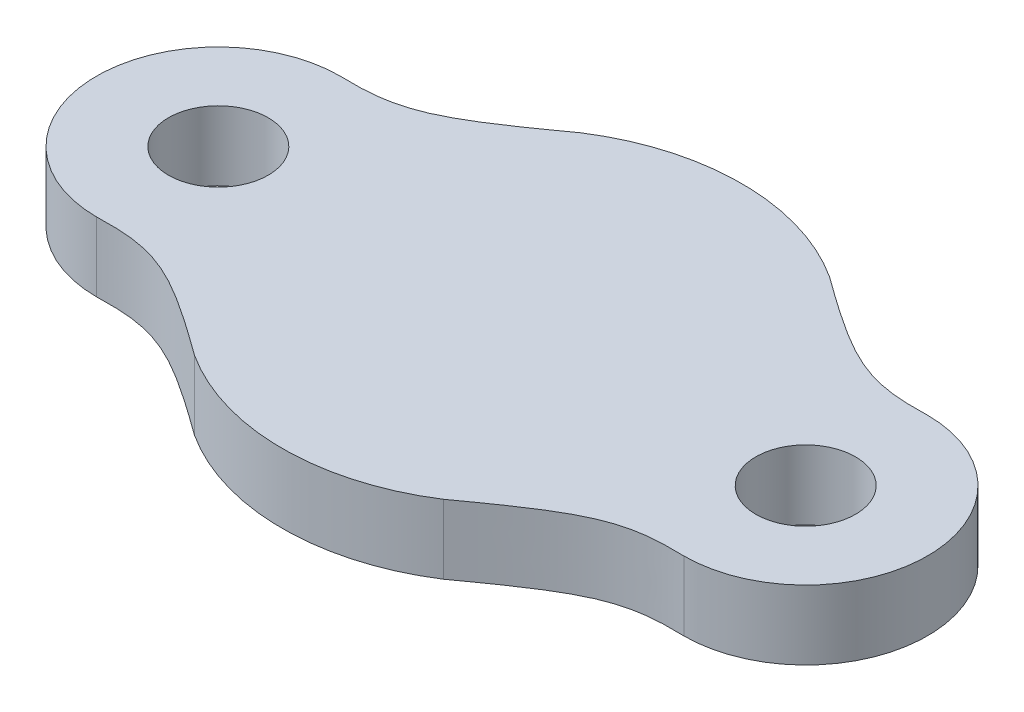
ISO-10303-21;
HEADER;
FILE_DESCRIPTION(('STEP AP214'),'2;1');
FILE_NAME('part.step','',(''),(''),'','','');
FILE_SCHEMA(('AUTOMOTIVE_DESIGN { 1 0 10303 214 1 1 1 1 }'));
ENDSEC;
DATA;
#1=APPLICATION_CONTEXT('core data for automotive mechanical design processes');
#2=APPLICATION_PROTOCOL_DEFINITION('international standard','automotive_design',2000,#1);
#3=PRODUCT_CONTEXT('',#1,'mechanical');
#4=PRODUCT('Part','Part','',(#3));
#5=PRODUCT_RELATED_PRODUCT_CATEGORY('part','',(#4));
#6=PRODUCT_DEFINITION_FORMATION('','',#4);
#7=PRODUCT_DEFINITION_CONTEXT('part definition',#1,'design');
#8=PRODUCT_DEFINITION('design','',#6,#7);
#9=PRODUCT_DEFINITION_SHAPE('','',#8);
#10=(LENGTH_UNIT() NAMED_UNIT(*) SI_UNIT(.MILLI.,.METRE.));
#11=(NAMED_UNIT(*) PLANE_ANGLE_UNIT() SI_UNIT($,.RADIAN.));
#12=(NAMED_UNIT(*) SI_UNIT($,.STERADIAN.) SOLID_ANGLE_UNIT());
#13=UNCERTAINTY_MEASURE_WITH_UNIT(LENGTH_MEASURE(1.E-05),#10,'distance_accuracy_value','');
#14=(GEOMETRIC_REPRESENTATION_CONTEXT(3) GLOBAL_UNCERTAINTY_ASSIGNED_CONTEXT((#13)) GLOBAL_UNIT_ASSIGNED_CONTEXT((#10,
#11,#12)) REPRESENTATION_CONTEXT('',''));
#15=CARTESIAN_POINT('',(0.,0.,0.));
#16=DIRECTION('',(0.,0.,1.));
#17=DIRECTION('',(1.,0.,0.));
#18=AXIS2_PLACEMENT_3D('',#15,#16,#17);
#19=CARTESIAN_POINT('',(-0.320319099064407,1.5875,-2.794));
#20=CARTESIAN_POINT('',(-1.72067868930703,1.5875,-2.74521085557607));
#21=CARTESIAN_POINT('',(-2.2941956749135,1.5875,-3.04322494082172));
#22=CARTESIAN_POINT('',(-4.1964053291224,1.5875,-4.42078880022508));
#23=B_SPLINE_CURVE_WITH_KNOTS('',3,(#19,#20,#21,#22),.UNSPECIFIED.,.F.,.F.,(4,4),(0.,1.),.UNSPECIFIED.);
#24=DIRECTION('',(0.,-1.,0.));
#25=VECTOR('',#24,1.);
#26=SURFACE_OF_LINEAR_EXTRUSION('',#23,#25);
#27=CARTESIAN_POINT('',(-0.320319099064407,0.,-2.794));
#28=CARTESIAN_POINT('',(-1.72067868930703,0.,-2.74521085557607));
#29=CARTESIAN_POINT('',(-2.2941956749135,0.,-3.04322494082172));
#30=CARTESIAN_POINT('',(-4.1964053291224,0.,-4.42078880022508));
#31=B_SPLINE_CURVE_WITH_KNOTS('',3,(#27,#28,#29,#30),.UNSPECIFIED.,.F.,.F.,(4,4),(0.,1.),.UNSPECIFIED.);
#32=CARTESIAN_POINT('',(-0.320319099064407,0.,-2.794));
#33=VERTEX_POINT('',#32);
#34=CARTESIAN_POINT('',(-4.1964053291224,0.,-4.42078880022508));
#35=VERTEX_POINT('',#34);
#36=EDGE_CURVE('E229',#33,#35,#31,.T.);
#37=ORIENTED_EDGE('',*,*,#36,.T.);
#38=DIRECTION('',(0.,-1.,0.));
#39=VECTOR('',#38,1.);
#40=CARTESIAN_POINT('',(-4.1964053291224,1.5875,-4.42078880022508));
#41=LINE('',#40,#39);
#42=CARTESIAN_POINT('',(-4.1964053291224,1.5875,-4.42078880022508));
#43=VERTEX_POINT('',#42);
#44=EDGE_CURVE('E11',#43,#35,#41,.T.);
#45=ORIENTED_EDGE('',*,*,#44,.F.);
#46=CARTESIAN_POINT('',(-0.320319099064407,1.5875,-2.794));
#47=VERTEX_POINT('',#46);
#48=EDGE_CURVE('E198',#47,#43,#23,.T.);
#49=ORIENTED_EDGE('',*,*,#48,.F.);
#50=DIRECTION('',(0.,-1.,0.));
#51=VECTOR('',#50,1.);
#52=CARTESIAN_POINT('',(-0.320319099064407,1.5875,-2.794));
#53=LINE('',#52,#51);
#54=EDGE_CURVE('E54',#47,#33,#53,.T.);
#55=ORIENTED_EDGE('',*,*,#54,.T.);
#56=EDGE_LOOP('',(#37,#45,#49,#55));
#57=FACE_BOUND('',#56,.T.);
#58=ADVANCED_FACE('F37',(#57),#26,.F.);
#59=CARTESIAN_POINT('',(-7.05131909906441,1.5875,0.));
#60=DIRECTION('',(0.,-1.,0.));
#61=DIRECTION('',(0.,0.,-1.));
#62=AXIS2_PLACEMENT_3D('',#59,#60,#61);
#63=CYLINDRICAL_SURFACE('',#62,5.2625);
#64=CARTESIAN_POINT('',(-7.05131909906441,0.,0.));
#65=DIRECTION('',(0.,1.,0.));
#66=DIRECTION('',(0.,0.,1.));
#67=AXIS2_PLACEMENT_3D('',#64,#65,#66);
#68=CIRCLE('',#67,5.2625);
#69=CARTESIAN_POINT('',(-9.90623286900642,0.,-4.42078880022508));
#70=VERTEX_POINT('',#69);
#71=EDGE_CURVE('E224',#35,#70,#68,.T.);
#72=ORIENTED_EDGE('',*,*,#71,.T.);
#73=DIRECTION('',(0.,-1.,0.));
#74=VECTOR('',#73,1.);
#75=CARTESIAN_POINT('',(-9.90623286900642,1.5875,-4.42078880022508));
#76=LINE('',#75,#74);
#77=CARTESIAN_POINT('',(-9.90623286900642,1.5875,-4.42078880022508));
#78=VERTEX_POINT('',#77);
#79=EDGE_CURVE('E46',#78,#70,#76,.T.);
#80=ORIENTED_EDGE('',*,*,#79,.F.);
#81=CARTESIAN_POINT('',(-7.05131909906441,1.5875,0.));
#82=DIRECTION('',(0.,1.,0.));
#83=DIRECTION('',(0.,0.,1.));
#84=AXIS2_PLACEMENT_3D('',#81,#82,#83);
#85=CIRCLE('',#84,5.2625);
#86=EDGE_CURVE('E92',#43,#78,#85,.T.);
#87=ORIENTED_EDGE('',*,*,#86,.F.);
#88=ORIENTED_EDGE('',*,*,#44,.T.);
#89=EDGE_LOOP('',(#72,#80,#87,#88));
#90=FACE_BOUND('',#89,.T.);
#91=ADVANCED_FACE('F158',(#90),#63,.T.);
#92=CARTESIAN_POINT('',(-13.7823190990644,1.5875,-2.794));
#93=CARTESIAN_POINT('',(-12.3819595088218,1.5875,-2.74521085557607));
#94=CARTESIAN_POINT('',(-11.8084425232153,1.5875,-3.04322494082172));
#95=CARTESIAN_POINT('',(-9.90623286900642,1.5875,-4.42078880022508));
#96=B_SPLINE_CURVE_WITH_KNOTS('',3,(#92,#93,#94,#95),.UNSPECIFIED.,.F.,.F.,(4,4),(0.,1.),.UNSPECIFIED.);
#97=DIRECTION('',(0.,-1.,0.));
#98=VECTOR('',#97,1.);
#99=SURFACE_OF_LINEAR_EXTRUSION('',#96,#98);
#100=CARTESIAN_POINT('',(-13.7823190990644,0.,-2.794));
#101=CARTESIAN_POINT('',(-12.3819595088218,0.,-2.74521085557607));
#102=CARTESIAN_POINT('',(-11.8084425232153,0.,-3.04322494082172));
#103=CARTESIAN_POINT('',(-9.90623286900642,0.,-4.42078880022508));
#104=B_SPLINE_CURVE_WITH_KNOTS('',3,(#100,#101,#102,#103),.UNSPECIFIED.,.F.,.F.,(4,4),(0.,1.),.UNSPECIFIED.);
#105=CARTESIAN_POINT('',(-13.7823190990644,0.,-2.794));
#106=VERTEX_POINT('',#105);
#107=EDGE_CURVE('E186',#106,#70,#104,.T.);
#108=ORIENTED_EDGE('',*,*,#107,.F.);
#109=DIRECTION('',(0.,-1.,0.));
#110=VECTOR('',#109,1.);
#111=CARTESIAN_POINT('',(-13.7823190990644,1.5875,-2.794));
#112=LINE('',#111,#110);
#113=CARTESIAN_POINT('',(-13.7823190990644,1.5875,-2.794));
#114=VERTEX_POINT('',#113);
#115=EDGE_CURVE('E180',#114,#106,#112,.T.);
#116=ORIENTED_EDGE('',*,*,#115,.F.);
#117=EDGE_CURVE('E169',#114,#78,#96,.T.);
#118=ORIENTED_EDGE('',*,*,#117,.T.);
#119=ORIENTED_EDGE('',*,*,#79,.T.);
#120=EDGE_LOOP('',(#108,#116,#118,#119));
#121=FACE_BOUND('',#120,.T.);
#122=ADVANCED_FACE('F164',(#121),#99,.T.);
#123=CARTESIAN_POINT('',(-13.7823190990644,1.5875,0.));
#124=DIRECTION('',(0.,-1.,0.));
#125=DIRECTION('',(0.,0.,-1.));
#126=AXIS2_PLACEMENT_3D('',#123,#124,#125);
#127=CYLINDRICAL_SURFACE('',#126,2.794);
#128=CARTESIAN_POINT('',(-13.7823190990644,0.,0.));
#129=DIRECTION('',(0.,1.,0.));
#130=DIRECTION('',(0.,0.,1.));
#131=AXIS2_PLACEMENT_3D('',#128,#129,#130);
#132=CIRCLE('',#131,2.794);
#133=CARTESIAN_POINT('',(-13.7823190990644,0.,2.794));
#134=VERTEX_POINT('',#133);
#135=EDGE_CURVE('E216',#134,#106,#132,.F.);
#136=ORIENTED_EDGE('',*,*,#135,.F.);
#137=DIRECTION('',(0.,-1.,0.));
#138=VECTOR('',#137,1.);
#139=CARTESIAN_POINT('',(-13.7823190990644,1.5875,2.794));
#140=LINE('',#139,#138);
#141=CARTESIAN_POINT('',(-13.7823190990644,1.5875,2.794));
#142=VERTEX_POINT('',#141);
#143=EDGE_CURVE('E182',#142,#134,#140,.T.);
#144=ORIENTED_EDGE('',*,*,#143,.F.);
#145=CARTESIAN_POINT('',(-13.7823190990644,1.5875,0.));
#146=DIRECTION('',(0.,1.,0.));
#147=DIRECTION('',(0.,0.,1.));
#148=AXIS2_PLACEMENT_3D('',#145,#146,#147);
#149=CIRCLE('',#148,2.794);
#150=EDGE_CURVE('E174',#142,#114,#149,.F.);
#151=ORIENTED_EDGE('',*,*,#150,.T.);
#152=ORIENTED_EDGE('',*,*,#115,.T.);
#153=EDGE_LOOP('',(#136,#144,#151,#152));
#154=FACE_BOUND('',#153,.T.);
#155=ADVANCED_FACE('F161',(#154),#127,.T.);
#156=CARTESIAN_POINT('',(-13.7823190990644,1.5875,2.794));
#157=CARTESIAN_POINT('',(-12.3819595088218,1.5875,2.74521085557607));
#158=CARTESIAN_POINT('',(-11.8084425232153,1.5875,3.04322494082172));
#159=CARTESIAN_POINT('',(-9.90623286900642,1.5875,4.42078880022508));
#160=B_SPLINE_CURVE_WITH_KNOTS('',3,(#156,#157,#158,#159),.UNSPECIFIED.,.F.,.F.,(4,4),(0.,1.),.UNSPECIFIED.);
#161=DIRECTION('',(0.,-1.,0.));
#162=VECTOR('',#161,1.);
#163=SURFACE_OF_LINEAR_EXTRUSION('',#160,#162);
#164=CARTESIAN_POINT('',(-13.7823190990644,0.,2.794));
#165=CARTESIAN_POINT('',(-12.3819595088218,0.,2.74521085557607));
#166=CARTESIAN_POINT('',(-11.8084425232153,0.,3.04322494082172));
#167=CARTESIAN_POINT('',(-9.90623286900642,0.,4.42078880022508));
#168=B_SPLINE_CURVE_WITH_KNOTS('',3,(#164,#165,#166,#167),.UNSPECIFIED.,.F.,.F.,(4,4),(0.,1.),.UNSPECIFIED.);
#169=CARTESIAN_POINT('',(-9.90623286900642,0.,4.42078880022508));
#170=VERTEX_POINT('',#169);
#171=EDGE_CURVE('E209',#134,#170,#168,.T.);
#172=ORIENTED_EDGE('',*,*,#171,.T.);
#173=DIRECTION('',(0.,-1.,0.));
#174=VECTOR('',#173,1.);
#175=CARTESIAN_POINT('',(-9.90623286900642,1.5875,4.42078880022508));
#176=LINE('',#175,#174);
#177=CARTESIAN_POINT('',(-9.90623286900642,1.5875,4.42078880022508));
#178=VERTEX_POINT('',#177);
#179=EDGE_CURVE('E129',#178,#170,#176,.T.);
#180=ORIENTED_EDGE('',*,*,#179,.F.);
#181=EDGE_CURVE('E117',#142,#178,#160,.T.);
#182=ORIENTED_EDGE('',*,*,#181,.F.);
#183=ORIENTED_EDGE('',*,*,#143,.T.);
#184=EDGE_LOOP('',(#172,#180,#182,#183));
#185=FACE_BOUND('',#184,.T.);
#186=ADVANCED_FACE('F157',(#185),#163,.F.);
#187=CARTESIAN_POINT('',(-4.1964053291224,0.,4.42078880022508));
#188=VERTEX_POINT('',#187);
#189=EDGE_CURVE('E126',#170,#188,#68,.T.);
#190=ORIENTED_EDGE('',*,*,#189,.T.);
#191=DIRECTION('',(0.,-1.,0.));
#192=VECTOR('',#191,1.);
#193=CARTESIAN_POINT('',(-4.1964053291224,1.5875,4.42078880022508));
#194=LINE('',#193,#192);
#195=CARTESIAN_POINT('',(-4.1964053291224,1.5875,4.42078880022508));
#196=VERTEX_POINT('',#195);
#197=EDGE_CURVE('E123',#196,#188,#194,.T.);
#198=ORIENTED_EDGE('',*,*,#197,.F.);
#199=EDGE_CURVE('E108',#178,#196,#85,.T.);
#200=ORIENTED_EDGE('',*,*,#199,.F.);
#201=ORIENTED_EDGE('',*,*,#179,.T.);
#202=EDGE_LOOP('',(#190,#198,#200,#201));
#203=FACE_BOUND('',#202,.T.);
#204=ADVANCED_FACE('F124',(#203),#63,.T.);
#205=CARTESIAN_POINT('',(-0.320319099064407,1.5875,2.794));
#206=CARTESIAN_POINT('',(-1.72067868930703,1.5875,2.74521085557607));
#207=CARTESIAN_POINT('',(-2.2941956749135,1.5875,3.04322494082172));
#208=CARTESIAN_POINT('',(-4.1964053291224,1.5875,4.42078880022508));
#209=B_SPLINE_CURVE_WITH_KNOTS('',3,(#205,#206,#207,#208),.UNSPECIFIED.,.F.,.F.,(4,4),(0.,1.),.UNSPECIFIED.);
#210=DIRECTION('',(0.,-1.,0.));
#211=VECTOR('',#210,1.);
#212=SURFACE_OF_LINEAR_EXTRUSION('',#209,#211);
#213=CARTESIAN_POINT('',(-0.320319099064407,0.,2.794));
#214=CARTESIAN_POINT('',(-1.72067868930703,0.,2.74521085557607));
#215=CARTESIAN_POINT('',(-2.2941956749135,0.,3.04322494082172));
#216=CARTESIAN_POINT('',(-4.1964053291224,0.,4.42078880022508));
#217=B_SPLINE_CURVE_WITH_KNOTS('',3,(#213,#214,#215,#216),.UNSPECIFIED.,.F.,.F.,(4,4),(0.,1.),.UNSPECIFIED.);
#218=CARTESIAN_POINT('',(-0.320319099064407,0.,2.794));
#219=VERTEX_POINT('',#218);
#220=EDGE_CURVE('E205',#219,#188,#217,.T.);
#221=ORIENTED_EDGE('',*,*,#220,.F.);
#222=DIRECTION('',(0.,-1.,0.));
#223=VECTOR('',#222,1.);
#224=CARTESIAN_POINT('',(-0.320319099064407,1.5875,2.794));
#225=LINE('',#224,#223);
#226=CARTESIAN_POINT('',(-0.320319099064407,1.5875,2.794));
#227=VERTEX_POINT('',#226);
#228=EDGE_CURVE('E80',#227,#219,#225,.T.);
#229=ORIENTED_EDGE('',*,*,#228,.F.);
#230=EDGE_CURVE('E114',#227,#196,#209,.T.);
#231=ORIENTED_EDGE('',*,*,#230,.T.);
#232=ORIENTED_EDGE('',*,*,#197,.T.);
#233=EDGE_LOOP('',(#221,#229,#231,#232));
#234=FACE_BOUND('',#233,.T.);
#235=ADVANCED_FACE('F131',(#234),#212,.T.);
#236=CARTESIAN_POINT('',(-0.320319099064406,1.5875,0.));
#237=DIRECTION('',(0.,-1.,0.));
#238=DIRECTION('',(0.,0.,-1.));
#239=AXIS2_PLACEMENT_3D('',#236,#237,#238);
#240=CYLINDRICAL_SURFACE('',#239,1.143);
#241=CARTESIAN_POINT('',(-0.320319099064406,1.5875,0.));
#242=DIRECTION('',(0.,1.,0.));
#243=DIRECTION('',(0.,0.,1.));
#244=AXIS2_PLACEMENT_3D('',#241,#242,#243);
#245=CIRCLE('',#244,1.143);
#246=CARTESIAN_POINT('',(-0.320319099064406,1.5875,1.143));
#247=VERTEX_POINT('',#246);
#248=EDGE_CURVE('E134',#247,#247,#245,.F.);
#249=ORIENTED_EDGE('',*,*,#248,.F.);
#250=EDGE_LOOP('',(#249));
#251=FACE_BOUND('',#250,.T.);
#252=CARTESIAN_POINT('',(-0.320319099064406,0.,0.));
#253=DIRECTION('',(0.,1.,0.));
#254=DIRECTION('',(0.,0.,1.));
#255=AXIS2_PLACEMENT_3D('',#252,#253,#254);
#256=CIRCLE('',#255,1.143);
#257=CARTESIAN_POINT('',(-0.320319099064406,0.,1.143));
#258=VERTEX_POINT('',#257);
#259=EDGE_CURVE('E199',#258,#258,#256,.F.);
#260=ORIENTED_EDGE('',*,*,#259,.T.);
#261=EDGE_LOOP('',(#260));
#262=FACE_BOUND('',#261,.T.);
#263=ADVANCED_FACE('F152',(#251,#262),#240,.F.);
#264=CARTESIAN_POINT('',(-0.320319099064406,1.5875,0.));
#265=DIRECTION('',(0.,-1.,0.));
#266=DIRECTION('',(0.,0.,-1.));
#267=AXIS2_PLACEMENT_3D('',#264,#265,#266);
#268=CYLINDRICAL_SURFACE('',#267,2.794);
#269=CARTESIAN_POINT('',(-0.320319099064406,0.,0.));
#270=DIRECTION('',(0.,1.,0.));
#271=DIRECTION('',(0.,0.,1.));
#272=AXIS2_PLACEMENT_3D('',#269,#270,#271);
#273=CIRCLE('',#272,2.794);
#274=EDGE_CURVE('E202',#33,#219,#273,.F.);
#275=ORIENTED_EDGE('',*,*,#274,.F.);
#276=ORIENTED_EDGE('',*,*,#54,.F.);
#277=CARTESIAN_POINT('',(-0.320319099064406,1.5875,0.));
#278=DIRECTION('',(0.,1.,0.));
#279=DIRECTION('',(0.,0.,1.));
#280=AXIS2_PLACEMENT_3D('',#277,#278,#279);
#281=CIRCLE('',#280,2.794);
#282=EDGE_CURVE('E132',#47,#227,#281,.F.);
#283=ORIENTED_EDGE('',*,*,#282,.T.);
#284=ORIENTED_EDGE('',*,*,#228,.T.);
#285=EDGE_LOOP('',(#275,#276,#283,#284));
#286=FACE_BOUND('',#285,.T.);
#287=ADVANCED_FACE('F153',(#286),#268,.T.);
#288=CARTESIAN_POINT('',(-13.7823190990644,1.5875,0.));
#289=DIRECTION('',(0.,-1.,0.));
#290=DIRECTION('',(0.,0.,-1.));
#291=AXIS2_PLACEMENT_3D('',#288,#289,#290);
#292=CYLINDRICAL_SURFACE('',#291,1.143);
#293=CARTESIAN_POINT('',(-13.7823190990644,1.5875,0.));
#294=DIRECTION('',(0.,1.,0.));
#295=DIRECTION('',(0.,0.,1.));
#296=AXIS2_PLACEMENT_3D('',#293,#294,#295);
#297=CIRCLE('',#296,1.143);
#298=CARTESIAN_POINT('',(-13.7823190990644,1.5875,1.143));
#299=VERTEX_POINT('',#298);
#300=EDGE_CURVE('E194',#299,#299,#297,.F.);
#301=ORIENTED_EDGE('',*,*,#300,.F.);
#302=EDGE_LOOP('',(#301));
#303=FACE_BOUND('',#302,.T.);
#304=CARTESIAN_POINT('',(-13.7823190990644,0.,0.));
#305=DIRECTION('',(0.,1.,0.));
#306=DIRECTION('',(0.,0.,1.));
#307=AXIS2_PLACEMENT_3D('',#304,#305,#306);
#308=CIRCLE('',#307,1.143);
#309=CARTESIAN_POINT('',(-13.7823190990644,0.,1.143));
#310=VERTEX_POINT('',#309);
#311=EDGE_CURVE('E195',#310,#310,#308,.F.);
#312=ORIENTED_EDGE('',*,*,#311,.T.);
#313=EDGE_LOOP('',(#312));
#314=FACE_BOUND('',#313,.T.);
#315=ADVANCED_FACE('F252',(#303,#314),#292,.F.);
#316=CARTESIAN_POINT('',(0.,1.5875,0.));
#317=DIRECTION('',(0.,1.,0.));
#318=DIRECTION('',(0.,0.,1.));
#319=AXIS2_PLACEMENT_3D('',#316,#317,#318);
#320=PLANE('',#319);
#321=ORIENTED_EDGE('',*,*,#48,.T.);
#322=ORIENTED_EDGE('',*,*,#86,.T.);
#323=ORIENTED_EDGE('',*,*,#117,.F.);
#324=ORIENTED_EDGE('',*,*,#150,.F.);
#325=ORIENTED_EDGE('',*,*,#181,.T.);
#326=ORIENTED_EDGE('',*,*,#199,.T.);
#327=ORIENTED_EDGE('',*,*,#230,.F.);
#328=ORIENTED_EDGE('',*,*,#282,.F.);
#329=EDGE_LOOP('',(#321,#322,#323,#324,#325,#326,#327,#328));
#330=FACE_BOUND('',#329,.T.);
#331=ORIENTED_EDGE('',*,*,#248,.T.);
#332=EDGE_LOOP('',(#331));
#333=FACE_BOUND('',#332,.T.);
#334=ORIENTED_EDGE('',*,*,#300,.T.);
#335=EDGE_LOOP('',(#334));
#336=FACE_BOUND('',#335,.T.);
#337=ADVANCED_FACE('F110',(#330,#333,#336),#320,.T.);
#338=CARTESIAN_POINT('',(0.,0.,0.));
#339=DIRECTION('',(0.,1.,0.));
#340=DIRECTION('',(0.,0.,1.));
#341=AXIS2_PLACEMENT_3D('',#338,#339,#340);
#342=PLANE('',#341);
#343=ORIENTED_EDGE('',*,*,#36,.F.);
#344=ORIENTED_EDGE('',*,*,#274,.T.);
#345=ORIENTED_EDGE('',*,*,#220,.T.);
#346=ORIENTED_EDGE('',*,*,#189,.F.);
#347=ORIENTED_EDGE('',*,*,#171,.F.);
#348=ORIENTED_EDGE('',*,*,#135,.T.);
#349=ORIENTED_EDGE('',*,*,#107,.T.);
#350=ORIENTED_EDGE('',*,*,#71,.F.);
#351=EDGE_LOOP('',(#343,#344,#345,#346,#347,#348,#349,#350));
#352=FACE_BOUND('',#351,.T.);
#353=ORIENTED_EDGE('',*,*,#259,.F.);
#354=EDGE_LOOP('',(#353));
#355=FACE_BOUND('',#354,.T.);
#356=ORIENTED_EDGE('',*,*,#311,.F.);
#357=EDGE_LOOP('',(#356));
#358=FACE_BOUND('',#357,.T.);
#359=ADVANCED_FACE('F245',(#352,#355,#358),#342,.F.);
#360=CLOSED_SHELL('',(#58,#91,#122,#155,#186,#204,#235,#263,#287,#315,#337,#359));
#361=MANIFOLD_SOLID_BREP('B2',#360);
#362=ADVANCED_BREP_SHAPE_REPRESENTATION('',(#18,#361),#14);
#363=SHAPE_DEFINITION_REPRESENTATION(#9,#362);
ENDSEC;
END-ISO-10303-21;
